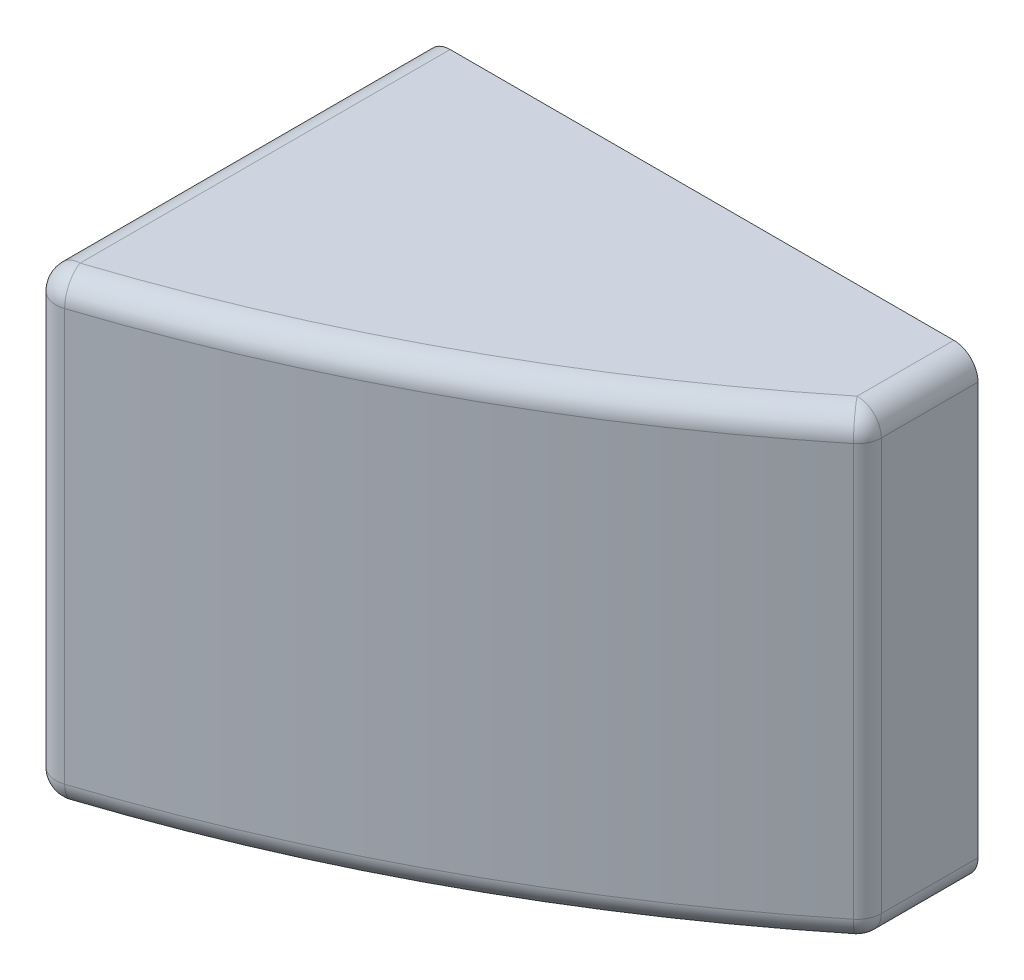
ISO-10303-21;
HEADER;
FILE_DESCRIPTION(('STEP AP214'),'2;1');
FILE_NAME('part.step','',(''),(''),'','','');
FILE_SCHEMA(('AUTOMOTIVE_DESIGN { 1 0 10303 214 1 1 1 1 }'));
ENDSEC;
DATA;
#1=APPLICATION_CONTEXT('core data for automotive mechanical design processes');
#2=APPLICATION_PROTOCOL_DEFINITION('international standard','automotive_design',2000,#1);
#3=PRODUCT_CONTEXT('',#1,'mechanical');
#4=PRODUCT('Part','Part','',(#3));
#5=PRODUCT_RELATED_PRODUCT_CATEGORY('part','',(#4));
#6=PRODUCT_DEFINITION_FORMATION('','',#4);
#7=PRODUCT_DEFINITION_CONTEXT('part definition',#1,'design');
#8=PRODUCT_DEFINITION('design','',#6,#7);
#9=PRODUCT_DEFINITION_SHAPE('','',#8);
#10=(LENGTH_UNIT() NAMED_UNIT(*) SI_UNIT(.MILLI.,.METRE.));
#11=(NAMED_UNIT(*) PLANE_ANGLE_UNIT() SI_UNIT($,.RADIAN.));
#12=(NAMED_UNIT(*) SI_UNIT($,.STERADIAN.) SOLID_ANGLE_UNIT());
#13=UNCERTAINTY_MEASURE_WITH_UNIT(LENGTH_MEASURE(1.E-05),#10,'distance_accuracy_value','');
#14=(GEOMETRIC_REPRESENTATION_CONTEXT(3) GLOBAL_UNCERTAINTY_ASSIGNED_CONTEXT((#13)) GLOBAL_UNIT_ASSIGNED_CONTEXT((#10,
#11,#12)) REPRESENTATION_CONTEXT('',''));
#15=CARTESIAN_POINT('',(0.,0.,0.));
#16=DIRECTION('',(0.,0.,1.));
#17=DIRECTION('',(1.,0.,0.));
#18=AXIS2_PLACEMENT_3D('',#15,#16,#17);
#19=CARTESIAN_POINT('',(0.,0.,4.));
#20=DIRECTION('',(1.,0.,0.));
#21=DIRECTION('',(0.,0.,-1.));
#22=AXIS2_PLACEMENT_3D('',#19,#20,#21);
#23=PLANE('',#22);
#24=DIRECTION('',(0.,-1.,0.));
#25=VECTOR('',#24,1.);
#26=CARTESIAN_POINT('',(0.,0.,3.06344697058111));
#27=LINE('',#26,#25);
#28=CARTESIAN_POINT('',(0.,0.2,3.06344697058111));
#29=VERTEX_POINT('',#28);
#30=CARTESIAN_POINT('',(0.,3.61,3.06344697058111));
#31=VERTEX_POINT('',#30);
#32=EDGE_CURVE('E206',#29,#31,#27,.F.);
#33=ORIENTED_EDGE('',*,*,#32,.T.);
#34=DIRECTION('',(0.,0.,-1.));
#35=VECTOR('',#34,1.);
#36=CARTESIAN_POINT('',(0.,3.61,4.));
#37=LINE('',#36,#35);
#38=CARTESIAN_POINT('',(0.,3.61,0.));
#39=VERTEX_POINT('',#38);
#40=EDGE_CURVE('E135',#31,#39,#37,.T.);
#41=ORIENTED_EDGE('',*,*,#40,.T.);
#42=DIRECTION('',(0.,-1.,0.));
#43=VECTOR('',#42,1.);
#44=CARTESIAN_POINT('',(0.,0.,0.));
#45=LINE('',#44,#43);
#46=CARTESIAN_POINT('',(0.,0.2,0.));
#47=VERTEX_POINT('',#46);
#48=EDGE_CURVE('E181',#39,#47,#45,.T.);
#49=ORIENTED_EDGE('',*,*,#48,.T.);
#50=DIRECTION('',(0.,0.,-1.));
#51=VECTOR('',#50,1.);
#52=CARTESIAN_POINT('',(0.,0.2,4.));
#53=LINE('',#52,#51);
#54=EDGE_CURVE('E204',#47,#29,#53,.F.);
#55=ORIENTED_EDGE('',*,*,#54,.T.);
#56=EDGE_LOOP('',(#33,#41,#49,#55));
#57=FACE_BOUND('',#56,.T.);
#58=ADVANCED_FACE('F33',(#57),#23,.F.);
#59=CARTESIAN_POINT('',(0.,0.,4.));
#60=DIRECTION('',(0.,1.,0.));
#61=DIRECTION('',(0.,0.,1.));
#62=AXIS2_PLACEMENT_3D('',#59,#60,#61);
#63=PLANE('',#62);
#64=CARTESIAN_POINT('',(-3.91214099886757,0.,-9.48800734559829));
#65=DIRECTION('',(0.,1.,0.));
#66=DIRECTION('',(0.,0.,1.));
#67=AXIS2_PLACEMENT_3D('',#64,#65,#66);
#68=CIRCLE('',#67,13.2079032796923);
#69=CARTESIAN_POINT('',(4.37,0.,0.800571250135082));
#70=VERTEX_POINT('',#69);
#71=CARTESIAN_POINT('',(0.2,0.,3.06344697058111));
#72=VERTEX_POINT('',#71);
#73=EDGE_CURVE('E140',#70,#72,#68,.F.);
#74=ORIENTED_EDGE('',*,*,#73,.T.);
#75=DIRECTION('',(0.,0.,-1.));
#76=VECTOR('',#75,1.);
#77=CARTESIAN_POINT('',(0.2,0.,4.));
#78=LINE('',#77,#76);
#79=CARTESIAN_POINT('',(0.2,0.,0.));
#80=VERTEX_POINT('',#79);
#81=EDGE_CURVE('E144',#72,#80,#78,.T.);
#82=ORIENTED_EDGE('',*,*,#81,.T.);
#83=DIRECTION('',(1.,0.,0.));
#84=VECTOR('',#83,1.);
#85=CARTESIAN_POINT('',(0.,0.,0.));
#86=LINE('',#85,#84);
#87=CARTESIAN_POINT('',(4.37,0.,0.));
#88=VERTEX_POINT('',#87);
#89=EDGE_CURVE('E184',#80,#88,#86,.T.);
#90=ORIENTED_EDGE('',*,*,#89,.T.);
#91=DIRECTION('',(0.,0.,-1.));
#92=VECTOR('',#91,1.);
#93=CARTESIAN_POINT('',(4.37,0.,4.));
#94=LINE('',#93,#92);
#95=EDGE_CURVE('E142',#88,#70,#94,.F.);
#96=ORIENTED_EDGE('',*,*,#95,.T.);
#97=EDGE_LOOP('',(#74,#82,#90,#96));
#98=FACE_BOUND('',#97,.T.);
#99=ADVANCED_FACE('F240',(#98),#63,.F.);
#100=CARTESIAN_POINT('',(4.57,0.,4.));
#101=DIRECTION('',(-1.,0.,0.));
#102=DIRECTION('',(0.,-1.,0.));
#103=AXIS2_PLACEMENT_3D('',#100,#101,#102);
#104=PLANE('',#103);
#105=DIRECTION('',(0.,1.,0.));
#106=VECTOR('',#105,1.);
#107=CARTESIAN_POINT('',(4.57,0.,0.));
#108=LINE('',#107,#106);
#109=CARTESIAN_POINT('',(4.57,0.2,0.));
#110=VERTEX_POINT('',#109);
#111=CARTESIAN_POINT('',(4.57,3.61,0.));
#112=VERTEX_POINT('',#111);
#113=EDGE_CURVE('E128',#110,#112,#108,.T.);
#114=ORIENTED_EDGE('',*,*,#113,.T.);
#115=DIRECTION('',(0.,0.,-1.));
#116=VECTOR('',#115,1.);
#117=CARTESIAN_POINT('',(4.57,3.61,4.));
#118=LINE('',#117,#116);
#119=CARTESIAN_POINT('',(4.57,3.61,0.800571250135093));
#120=VERTEX_POINT('',#119);
#121=EDGE_CURVE('E11',#112,#120,#118,.F.);
#122=ORIENTED_EDGE('',*,*,#121,.T.);
#123=DIRECTION('',(0.,-1.,0.));
#124=VECTOR('',#123,1.);
#125=CARTESIAN_POINT('',(4.57,0.,0.800571250135093));
#126=LINE('',#125,#124);
#127=CARTESIAN_POINT('',(4.57,0.2,0.800571250135093));
#128=VERTEX_POINT('',#127);
#129=EDGE_CURVE('E49',#120,#128,#126,.T.);
#130=ORIENTED_EDGE('',*,*,#129,.T.);
#131=DIRECTION('',(0.,0.,-1.));
#132=VECTOR('',#131,1.);
#133=CARTESIAN_POINT('',(4.57,0.2,4.));
#134=LINE('',#133,#132);
#135=EDGE_CURVE('E42',#128,#110,#134,.T.);
#136=ORIENTED_EDGE('',*,*,#135,.T.);
#137=EDGE_LOOP('',(#114,#122,#130,#136));
#138=FACE_BOUND('',#137,.T.);
#139=ADVANCED_FACE('F238',(#138),#104,.F.);
#140=CARTESIAN_POINT('',(0.,3.81,4.));
#141=DIRECTION('',(0.,-1.,0.));
#142=DIRECTION('',(0.,0.,-1.));
#143=AXIS2_PLACEMENT_3D('',#140,#141,#142);
#144=PLANE('',#143);
#145=DIRECTION('',(-1.,0.,0.));
#146=VECTOR('',#145,1.);
#147=CARTESIAN_POINT('',(0.,3.81,0.));
#148=LINE('',#147,#146);
#149=CARTESIAN_POINT('',(4.37,3.81,0.));
#150=VERTEX_POINT('',#149);
#151=CARTESIAN_POINT('',(0.2,3.81,0.));
#152=VERTEX_POINT('',#151);
#153=EDGE_CURVE('E113',#150,#152,#148,.T.);
#154=ORIENTED_EDGE('',*,*,#153,.T.);
#155=DIRECTION('',(0.,0.,-1.));
#156=VECTOR('',#155,1.);
#157=CARTESIAN_POINT('',(0.2,3.81,4.));
#158=LINE('',#157,#156);
#159=CARTESIAN_POINT('',(0.2,3.81,3.06344697058111));
#160=VERTEX_POINT('',#159);
#161=EDGE_CURVE('E193',#152,#160,#158,.F.);
#162=ORIENTED_EDGE('',*,*,#161,.T.);
#163=CARTESIAN_POINT('',(-3.91214099886757,3.81,-9.48800734559829));
#164=DIRECTION('',(0.,-1.,0.));
#165=DIRECTION('',(0.,0.,-1.));
#166=AXIS2_PLACEMENT_3D('',#163,#164,#165);
#167=CIRCLE('',#166,13.2079032796923);
#168=CARTESIAN_POINT('',(4.37,3.81,0.800571250135086));
#169=VERTEX_POINT('',#168);
#170=EDGE_CURVE('E116',#160,#169,#167,.F.);
#171=ORIENTED_EDGE('',*,*,#170,.T.);
#172=DIRECTION('',(0.,0.,-1.));
#173=VECTOR('',#172,1.);
#174=CARTESIAN_POINT('',(4.37,3.81,4.));
#175=LINE('',#174,#173);
#176=EDGE_CURVE('E110',#169,#150,#175,.T.);
#177=ORIENTED_EDGE('',*,*,#176,.T.);
#178=EDGE_LOOP('',(#154,#162,#171,#177));
#179=FACE_BOUND('',#178,.T.);
#180=ADVANCED_FACE('F112',(#179),#144,.F.);
#181=CARTESIAN_POINT('',(0.,3.81,0.));
#182=DIRECTION('',(0.,0.,-1.));
#183=DIRECTION('',(-1.,0.,0.));
#184=AXIS2_PLACEMENT_3D('',#181,#182,#183);
#185=PLANE('',#184);
#186=ORIENTED_EDGE('',*,*,#48,.F.);
#187=CARTESIAN_POINT('',(0.2,3.61,0.));
#188=DIRECTION('',(0.,0.,-1.));
#189=DIRECTION('',(-1.,0.,0.));
#190=AXIS2_PLACEMENT_3D('',#187,#188,#189);
#191=CIRCLE('',#190,0.2);
#192=EDGE_CURVE('E127',#39,#152,#191,.T.);
#193=ORIENTED_EDGE('',*,*,#192,.T.);
#194=ORIENTED_EDGE('',*,*,#153,.F.);
#195=CARTESIAN_POINT('',(4.37,3.61,0.));
#196=DIRECTION('',(0.,0.,-1.));
#197=DIRECTION('',(-1.,0.,0.));
#198=AXIS2_PLACEMENT_3D('',#195,#196,#197);
#199=CIRCLE('',#198,0.2);
#200=EDGE_CURVE('E125',#150,#112,#199,.T.);
#201=ORIENTED_EDGE('',*,*,#200,.T.);
#202=ORIENTED_EDGE('',*,*,#113,.F.);
#203=CARTESIAN_POINT('',(4.37,0.2,0.));
#204=DIRECTION('',(0.,0.,-1.));
#205=DIRECTION('',(-1.,0.,0.));
#206=AXIS2_PLACEMENT_3D('',#203,#204,#205);
#207=CIRCLE('',#206,0.2);
#208=EDGE_CURVE('E132',#110,#88,#207,.T.);
#209=ORIENTED_EDGE('',*,*,#208,.T.);
#210=ORIENTED_EDGE('',*,*,#89,.F.);
#211=CARTESIAN_POINT('',(0.2,0.2,0.));
#212=DIRECTION('',(0.,0.,-1.));
#213=DIRECTION('',(-1.,0.,0.));
#214=AXIS2_PLACEMENT_3D('',#211,#212,#213);
#215=CIRCLE('',#214,0.2);
#216=EDGE_CURVE('E131',#80,#47,#215,.T.);
#217=ORIENTED_EDGE('',*,*,#216,.T.);
#218=EDGE_LOOP('',(#186,#193,#194,#201,#202,#209,#210,#217));
#219=FACE_BOUND('',#218,.T.);
#220=ADVANCED_FACE('F123',(#219),#185,.T.);
#221=CARTESIAN_POINT('',(-3.91214099886757,10.,-9.48800734559829));
#222=DIRECTION('',(0.,-1.,0.));
#223=DIRECTION('',(0.,0.,-1.));
#224=AXIS2_PLACEMENT_3D('',#221,#222,#223);
#225=CYLINDRICAL_SURFACE('',#224,13.4079032796923);
#226=DIRECTION('',(0.,-1.,0.));
#227=VECTOR('',#226,1.);
#228=CARTESIAN_POINT('',(4.49541189655138,10.,0.956365525393795));
#229=LINE('',#228,#227);
#230=CARTESIAN_POINT('',(4.49541189655138,0.200000000000001,0.956365525393794));
#231=VERTEX_POINT('',#230);
#232=CARTESIAN_POINT('',(4.49541189655138,3.61,0.956365525393793));
#233=VERTEX_POINT('',#232);
#234=EDGE_CURVE('E197',#231,#233,#229,.F.);
#235=ORIENTED_EDGE('',*,*,#234,.T.);
#236=CARTESIAN_POINT('',(-3.91214099886757,3.61,-9.48800734559829));
#237=DIRECTION('',(0.,-1.,0.));
#238=DIRECTION('',(0.,0.,-1.));
#239=AXIS2_PLACEMENT_3D('',#236,#237,#238);
#240=CIRCLE('',#239,13.4079032796923);
#241=CARTESIAN_POINT('',(0.262267884792738,3.61,3.25350672571996));
#242=VERTEX_POINT('',#241);
#243=EDGE_CURVE('E201',#233,#242,#240,.T.);
#244=ORIENTED_EDGE('',*,*,#243,.T.);
#245=DIRECTION('',(0.,-1.,0.));
#246=VECTOR('',#245,1.);
#247=CARTESIAN_POINT('',(0.262267884792738,10.,3.25350672571996));
#248=LINE('',#247,#246);
#249=CARTESIAN_POINT('',(0.262267884792738,0.200000000000001,3.25350672571996));
#250=VERTEX_POINT('',#249);
#251=EDGE_CURVE('E199',#242,#250,#248,.T.);
#252=ORIENTED_EDGE('',*,*,#251,.T.);
#253=CARTESIAN_POINT('',(-3.91214099886757,0.200000000000001,-9.48800734559829));
#254=DIRECTION('',(0.,1.,0.));
#255=DIRECTION('',(0.,0.,1.));
#256=AXIS2_PLACEMENT_3D('',#253,#254,#255);
#257=CIRCLE('',#256,13.4079032796923);
#258=EDGE_CURVE('E195',#250,#231,#257,.T.);
#259=ORIENTED_EDGE('',*,*,#258,.T.);
#260=EDGE_LOOP('',(#235,#244,#252,#259));
#261=FACE_BOUND('',#260,.T.);
#262=ADVANCED_FACE('F248',(#261),#225,.T.);
#263=CARTESIAN_POINT('',(0.2,0.2,4.));
#264=DIRECTION('',(0.,0.,-1.));
#265=DIRECTION('',(-1.,0.,0.));
#266=AXIS2_PLACEMENT_3D('',#263,#264,#265);
#267=CYLINDRICAL_SURFACE('',#266,0.2);
#268=ORIENTED_EDGE('',*,*,#216,.F.);
#269=ORIENTED_EDGE('',*,*,#81,.F.);
#270=CARTESIAN_POINT('',(0.2,0.2,3.06344697058111));
#271=DIRECTION('',(0.,0.,1.));
#272=DIRECTION('',(0.,-1.,0.));
#273=AXIS2_PLACEMENT_3D('',#270,#271,#272);
#274=CIRCLE('',#273,0.2);
#275=EDGE_CURVE('E175',#29,#72,#274,.T.);
#276=ORIENTED_EDGE('',*,*,#275,.F.);
#277=ORIENTED_EDGE('',*,*,#54,.F.);
#278=EDGE_LOOP('',(#268,#269,#276,#277));
#279=FACE_BOUND('',#278,.T.);
#280=ADVANCED_FACE('F35',(#279),#267,.T.);
#281=CARTESIAN_POINT('',(4.37,0.2,4.));
#282=DIRECTION('',(0.,0.,-1.));
#283=DIRECTION('',(-1.,0.,0.));
#284=AXIS2_PLACEMENT_3D('',#281,#282,#283);
#285=CYLINDRICAL_SURFACE('',#284,0.2);
#286=ORIENTED_EDGE('',*,*,#208,.F.);
#287=ORIENTED_EDGE('',*,*,#135,.F.);
#288=CARTESIAN_POINT('',(4.37,0.2,0.800571250135082));
#289=DIRECTION('',(0.,0.,1.));
#290=DIRECTION('',(1.,0.,0.));
#291=AXIS2_PLACEMENT_3D('',#288,#289,#290);
#292=CIRCLE('',#291,0.2);
#293=EDGE_CURVE('E173',#70,#128,#292,.T.);
#294=ORIENTED_EDGE('',*,*,#293,.F.);
#295=ORIENTED_EDGE('',*,*,#95,.F.);
#296=EDGE_LOOP('',(#286,#287,#294,#295));
#297=FACE_BOUND('',#296,.T.);
#298=ADVANCED_FACE('F237',(#297),#285,.T.);
#299=CARTESIAN_POINT('',(-3.91214099886757,0.200000000000001,-9.48800734559829));
#300=DIRECTION('',(0.,1.,0.));
#301=DIRECTION('',(0.,0.,1.));
#302=AXIS2_PLACEMENT_3D('',#299,#300,#301);
#303=TOROIDAL_SURFACE('',#302,13.2079032796923,0.2);
#304=CARTESIAN_POINT('',(0.2,0.2,3.06344697058111));
#305=DIRECTION('',(-0.950298775694234,0.,0.311339423963687));
#306=DIRECTION('',(0.311339423963687,0.,0.950298775694234));
#307=AXIS2_PLACEMENT_3D('',#304,#305,#306);
#308=CIRCLE('',#307,0.2);
#309=EDGE_CURVE('E37',#72,#250,#308,.T.);
#310=ORIENTED_EDGE('',*,*,#309,.F.);
#311=ORIENTED_EDGE('',*,*,#73,.F.);
#312=CARTESIAN_POINT('',(4.36999999999999,0.200000000000001,0.800571250135093));
#313=DIRECTION('',(0.778971376293504,0.,-0.627059482756942));
#314=DIRECTION('',(-0.627059482756942,0.,-0.778971376293504));
#315=AXIS2_PLACEMENT_3D('',#312,#313,#314);
#316=CIRCLE('',#315,0.2);
#317=EDGE_CURVE('E170',#231,#70,#316,.T.);
#318=ORIENTED_EDGE('',*,*,#317,.F.);
#319=ORIENTED_EDGE('',*,*,#258,.F.);
#320=EDGE_LOOP('',(#310,#311,#318,#319));
#321=FACE_BOUND('',#320,.T.);
#322=ADVANCED_FACE('F246',(#321),#303,.T.);
#323=CARTESIAN_POINT('',(0.2,0.2,3.06344697058111));
#324=DIRECTION('',(0.,0.,1.));
#325=DIRECTION('',(1.,0.,0.));
#326=AXIS2_PLACEMENT_3D('',#323,#324,#325);
#327=SPHERICAL_SURFACE('',#326,0.2);
#328=ORIENTED_EDGE('',*,*,#275,.T.);
#329=ORIENTED_EDGE('',*,*,#309,.T.);
#330=CARTESIAN_POINT('',(0.199999999999999,0.200000000000001,3.06344697058111));
#331=DIRECTION('',(0.,-1.,0.));
#332=DIRECTION('',(1.,0.,0.));
#333=AXIS2_PLACEMENT_3D('',#330,#331,#332);
#334=CIRCLE('',#333,0.2);
#335=EDGE_CURVE('E167',#29,#250,#334,.F.);
#336=ORIENTED_EDGE('',*,*,#335,.F.);
#337=EDGE_LOOP('',(#328,#329,#336));
#338=FACE_BOUND('',#337,.T.);
#339=ADVANCED_FACE('F251',(#338),#327,.T.);
#340=CARTESIAN_POINT('',(4.37,0.2,0.800571250135082));
#341=DIRECTION('',(0.,0.,1.));
#342=DIRECTION('',(1.,0.,0.));
#343=AXIS2_PLACEMENT_3D('',#340,#341,#342);
#344=SPHERICAL_SURFACE('',#343,0.2);
#345=ORIENTED_EDGE('',*,*,#317,.T.);
#346=ORIENTED_EDGE('',*,*,#293,.T.);
#347=CARTESIAN_POINT('',(4.37,0.2,0.800571250135093));
#348=DIRECTION('',(0.,-1.,0.));
#349=DIRECTION('',(0.,0.,-1.));
#350=AXIS2_PLACEMENT_3D('',#347,#348,#349);
#351=CIRCLE('',#350,0.2);
#352=EDGE_CURVE('E164',#231,#128,#351,.F.);
#353=ORIENTED_EDGE('',*,*,#352,.F.);
#354=EDGE_LOOP('',(#345,#346,#353));
#355=FACE_BOUND('',#354,.T.);
#356=ADVANCED_FACE('F231',(#355),#344,.T.);
#357=CARTESIAN_POINT('',(0.2,10.,3.06344697058111));
#358=DIRECTION('',(0.,-1.,0.));
#359=DIRECTION('',(0.,0.,-1.));
#360=AXIS2_PLACEMENT_3D('',#357,#358,#359);
#361=CYLINDRICAL_SURFACE('',#360,0.2);
#362=ORIENTED_EDGE('',*,*,#335,.T.);
#363=ORIENTED_EDGE('',*,*,#251,.F.);
#364=CARTESIAN_POINT('',(0.2,3.61,3.06344697058111));
#365=DIRECTION('',(0.,1.,0.));
#366=DIRECTION('',(0.,0.,1.));
#367=AXIS2_PLACEMENT_3D('',#364,#365,#366);
#368=CIRCLE('',#367,0.2);
#369=EDGE_CURVE('E161',#31,#242,#368,.T.);
#370=ORIENTED_EDGE('',*,*,#369,.F.);
#371=ORIENTED_EDGE('',*,*,#32,.F.);
#372=EDGE_LOOP('',(#362,#363,#370,#371));
#373=FACE_BOUND('',#372,.T.);
#374=ADVANCED_FACE('F250',(#373),#361,.T.);
#375=CARTESIAN_POINT('',(0.2,3.61,4.));
#376=DIRECTION('',(0.,0.,-1.));
#377=DIRECTION('',(-1.,0.,0.));
#378=AXIS2_PLACEMENT_3D('',#375,#376,#377);
#379=CYLINDRICAL_SURFACE('',#378,0.2);
#380=ORIENTED_EDGE('',*,*,#192,.F.);
#381=ORIENTED_EDGE('',*,*,#40,.F.);
#382=CARTESIAN_POINT('',(0.2,3.61,3.06344697058111));
#383=DIRECTION('',(0.,0.,1.));
#384=DIRECTION('',(1.,0.,0.));
#385=AXIS2_PLACEMENT_3D('',#382,#383,#384);
#386=CIRCLE('',#385,0.2);
#387=EDGE_CURVE('E158',#160,#31,#386,.T.);
#388=ORIENTED_EDGE('',*,*,#387,.F.);
#389=ORIENTED_EDGE('',*,*,#161,.F.);
#390=EDGE_LOOP('',(#380,#381,#388,#389));
#391=FACE_BOUND('',#390,.T.);
#392=ADVANCED_FACE('F214',(#391),#379,.T.);
#393=CARTESIAN_POINT('',(4.37,3.61,4.));
#394=DIRECTION('',(0.,0.,-1.));
#395=DIRECTION('',(-1.,0.,0.));
#396=AXIS2_PLACEMENT_3D('',#393,#394,#395);
#397=CYLINDRICAL_SURFACE('',#396,0.2);
#398=ORIENTED_EDGE('',*,*,#200,.F.);
#399=ORIENTED_EDGE('',*,*,#176,.F.);
#400=CARTESIAN_POINT('',(4.37,3.61,0.800571250135093));
#401=DIRECTION('',(0.,0.,1.));
#402=DIRECTION('',(0.,-1.,0.));
#403=AXIS2_PLACEMENT_3D('',#400,#401,#402);
#404=CIRCLE('',#403,0.2);
#405=EDGE_CURVE('E155',#120,#169,#404,.T.);
#406=ORIENTED_EDGE('',*,*,#405,.F.);
#407=ORIENTED_EDGE('',*,*,#121,.F.);
#408=EDGE_LOOP('',(#398,#399,#406,#407));
#409=FACE_BOUND('',#408,.T.);
#410=ADVANCED_FACE('F130',(#409),#397,.T.);
#411=CARTESIAN_POINT('',(4.36999999999999,10.,0.800571250135093));
#412=DIRECTION('',(0.,-1.,0.));
#413=DIRECTION('',(0.,0.,-1.));
#414=AXIS2_PLACEMENT_3D('',#411,#412,#413);
#415=CYLINDRICAL_SURFACE('',#414,0.2);
#416=ORIENTED_EDGE('',*,*,#352,.T.);
#417=ORIENTED_EDGE('',*,*,#129,.F.);
#418=CARTESIAN_POINT('',(4.36999999999999,3.61,0.800571250135093));
#419=DIRECTION('',(0.,1.,0.));
#420=DIRECTION('',(-1.,0.,0.));
#421=AXIS2_PLACEMENT_3D('',#418,#419,#420);
#422=CIRCLE('',#421,0.2);
#423=EDGE_CURVE('E152',#233,#120,#422,.T.);
#424=ORIENTED_EDGE('',*,*,#423,.F.);
#425=ORIENTED_EDGE('',*,*,#234,.F.);
#426=EDGE_LOOP('',(#416,#417,#424,#425));
#427=FACE_BOUND('',#426,.T.);
#428=ADVANCED_FACE('F228',(#427),#415,.T.);
#429=CARTESIAN_POINT('',(0.2,3.61,3.06344697058111));
#430=DIRECTION('',(0.,0.,1.));
#431=DIRECTION('',(1.,0.,0.));
#432=AXIS2_PLACEMENT_3D('',#429,#430,#431);
#433=SPHERICAL_SURFACE('',#432,0.2);
#434=ORIENTED_EDGE('',*,*,#387,.T.);
#435=ORIENTED_EDGE('',*,*,#369,.T.);
#436=CARTESIAN_POINT('',(0.199999999999999,3.61,3.06344697058111));
#437=DIRECTION('',(-0.950298775694232,0.,0.311339423963694));
#438=DIRECTION('',(0.311339423963694,0.,0.950298775694232));
#439=AXIS2_PLACEMENT_3D('',#436,#437,#438);
#440=CIRCLE('',#439,0.2);
#441=EDGE_CURVE('E150',#160,#242,#440,.F.);
#442=ORIENTED_EDGE('',*,*,#441,.F.);
#443=EDGE_LOOP('',(#434,#435,#442));
#444=FACE_BOUND('',#443,.T.);
#445=ADVANCED_FACE('F217',(#444),#433,.T.);
#446=CARTESIAN_POINT('',(4.37,3.61,0.800571250135086));
#447=DIRECTION('',(0.,0.,1.));
#448=DIRECTION('',(1.,0.,0.));
#449=AXIS2_PLACEMENT_3D('',#446,#447,#448);
#450=SPHERICAL_SURFACE('',#449,0.2);
#451=ORIENTED_EDGE('',*,*,#423,.T.);
#452=ORIENTED_EDGE('',*,*,#405,.T.);
#453=CARTESIAN_POINT('',(4.37,3.61,0.800571250135086));
#454=DIRECTION('',(0.778971376293536,0.,-0.627059482756902));
#455=DIRECTION('',(-0.627059482756902,0.,-0.778971376293536));
#456=AXIS2_PLACEMENT_3D('',#453,#454,#455);
#457=CIRCLE('',#456,0.2);
#458=EDGE_CURVE('E148',#233,#169,#457,.F.);
#459=ORIENTED_EDGE('',*,*,#458,.F.);
#460=EDGE_LOOP('',(#451,#452,#459));
#461=FACE_BOUND('',#460,.T.);
#462=ADVANCED_FACE('F224',(#461),#450,.T.);
#463=CARTESIAN_POINT('',(-3.91214099886757,3.61,-9.48800734559829));
#464=DIRECTION('',(0.,-1.,0.));
#465=DIRECTION('',(0.,0.,-1.));
#466=AXIS2_PLACEMENT_3D('',#463,#464,#465);
#467=TOROIDAL_SURFACE('',#466,13.2079032796923,0.2);
#468=ORIENTED_EDGE('',*,*,#441,.T.);
#469=ORIENTED_EDGE('',*,*,#243,.F.);
#470=ORIENTED_EDGE('',*,*,#458,.T.);
#471=ORIENTED_EDGE('',*,*,#170,.F.);
#472=EDGE_LOOP('',(#468,#469,#470,#471));
#473=FACE_BOUND('',#472,.T.);
#474=ADVANCED_FACE('F221',(#473),#467,.T.);
#475=CLOSED_SHELL('',(#58,#99,#139,#180,#220,#262,#280,#298,#322,#339,#356,#374,#392,#410,#428,
#445,#462,#474));
#476=MANIFOLD_SOLID_BREP('B2',#475);
#477=ADVANCED_BREP_SHAPE_REPRESENTATION('',(#18,#476),#14);
#478=SHAPE_DEFINITION_REPRESENTATION(#9,#477);
ENDSEC;
END-ISO-10303-21;
